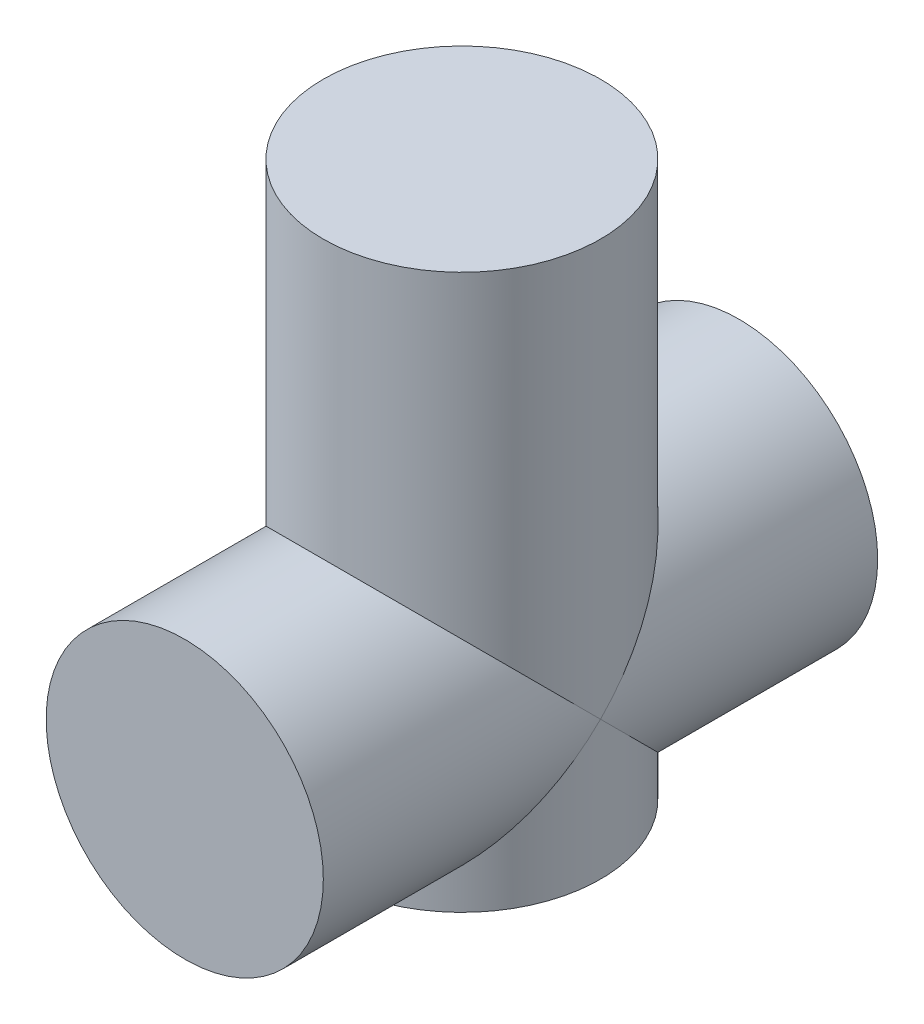
ISO-10303-21;
HEADER;
FILE_DESCRIPTION(('STEP AP214'),'2;1');
FILE_NAME('part.step','',(''),(''),'','','');
FILE_SCHEMA(('AUTOMOTIVE_DESIGN { 1 0 10303 214 1 1 1 1 }'));
ENDSEC;
DATA;
#1=APPLICATION_CONTEXT('core data for automotive mechanical design processes');
#2=APPLICATION_PROTOCOL_DEFINITION('international standard','automotive_design',2000,#1);
#3=PRODUCT_CONTEXT('',#1,'mechanical');
#4=PRODUCT('Part','Part','',(#3));
#5=PRODUCT_RELATED_PRODUCT_CATEGORY('part','',(#4));
#6=PRODUCT_DEFINITION_FORMATION('','',#4);
#7=PRODUCT_DEFINITION_CONTEXT('part definition',#1,'design');
#8=PRODUCT_DEFINITION('design','',#6,#7);
#9=PRODUCT_DEFINITION_SHAPE('','',#8);
#10=(LENGTH_UNIT() NAMED_UNIT(*) SI_UNIT(.MILLI.,.METRE.));
#11=(NAMED_UNIT(*) PLANE_ANGLE_UNIT() SI_UNIT($,.RADIAN.));
#12=(NAMED_UNIT(*) SI_UNIT($,.STERADIAN.) SOLID_ANGLE_UNIT());
#13=UNCERTAINTY_MEASURE_WITH_UNIT(LENGTH_MEASURE(1.E-05),#10,'distance_accuracy_value','');
#14=(GEOMETRIC_REPRESENTATION_CONTEXT(3) GLOBAL_UNCERTAINTY_ASSIGNED_CONTEXT((#13)) GLOBAL_UNIT_ASSIGNED_CONTEXT((#10,
#11,#12)) REPRESENTATION_CONTEXT('',''));
#15=CARTESIAN_POINT('',(0.,0.,0.));
#16=DIRECTION('',(0.,0.,1.));
#17=DIRECTION('',(1.,0.,0.));
#18=AXIS2_PLACEMENT_3D('',#15,#16,#17);
#19=CARTESIAN_POINT('',(0.,100.,0.));
#20=DIRECTION('',(0.,-1.,0.));
#21=DIRECTION('',(0.,0.,-1.));
#22=AXIS2_PLACEMENT_3D('',#19,#20,#21);
#23=CYLINDRICAL_SURFACE('',#22,25.);
#24=CARTESIAN_POINT('',(0.,25.,0.));
#25=DIRECTION('',(0.,-0.707106781186547,-0.707106781186547));
#26=DIRECTION('',(0.,-0.707106781186547,0.707106781186547));
#27=AXIS2_PLACEMENT_3D('',#24,#25,#26);
#28=ELLIPSE('',#27,35.3553390593274,25.);
#29=CARTESIAN_POINT('',(0.,0.,25.));
#30=VERTEX_POINT('',#29);
#31=CARTESIAN_POINT('',(-25.,25.,0.));
#32=VERTEX_POINT('',#31);
#33=EDGE_CURVE('E68',#30,#32,#28,.T.);
#34=ORIENTED_EDGE('',*,*,#33,.T.);
#35=CARTESIAN_POINT('',(0.,25.,0.));
#36=DIRECTION('',(0.,-0.707106781186547,0.707106781186547));
#37=DIRECTION('',(0.,-0.707106781186547,-0.707106781186547));
#38=AXIS2_PLACEMENT_3D('',#35,#36,#37);
#39=ELLIPSE('',#38,35.3553390593274,25.);
#40=CARTESIAN_POINT('',(0.,0.,-25.));
#41=VERTEX_POINT('',#40);
#42=EDGE_CURVE('E65',#32,#41,#39,.T.);
#43=ORIENTED_EDGE('',*,*,#42,.T.);
#44=CARTESIAN_POINT('',(0.,0.,0.));
#45=DIRECTION('',(0.,1.,0.));
#46=DIRECTION('',(0.,0.,1.));
#47=AXIS2_PLACEMENT_3D('',#44,#45,#46);
#48=CIRCLE('',#47,25.);
#49=EDGE_CURVE('E74',#41,#30,#48,.T.);
#50=ORIENTED_EDGE('',*,*,#49,.T.);
#51=EDGE_LOOP('',(#34,#43,#50));
#52=FACE_BOUND('',#51,.T.);
#53=ADVANCED_FACE('F33',(#52),#23,.T.);
#54=EDGE_CURVE('E37',#30,#41,#48,.T.);
#55=ORIENTED_EDGE('',*,*,#54,.T.);
#56=CARTESIAN_POINT('',(25.,25.,0.));
#57=VERTEX_POINT('',#56);
#58=EDGE_CURVE('E62',#41,#57,#39,.T.);
#59=ORIENTED_EDGE('',*,*,#58,.T.);
#60=EDGE_CURVE('E55',#57,#30,#28,.T.);
#61=ORIENTED_EDGE('',*,*,#60,.T.);
#62=EDGE_LOOP('',(#55,#59,#61));
#63=FACE_BOUND('',#62,.T.);
#64=ADVANCED_FACE('F35',(#63),#23,.T.);
#65=CARTESIAN_POINT('',(0.,0.,0.));
#66=DIRECTION('',(0.,1.,0.));
#67=DIRECTION('',(0.,0.,1.));
#68=AXIS2_PLACEMENT_3D('',#65,#66,#67);
#69=PLANE('',#68);
#70=ORIENTED_EDGE('',*,*,#49,.F.);
#71=ORIENTED_EDGE('',*,*,#54,.F.);
#72=EDGE_LOOP('',(#70,#71));
#73=FACE_BOUND('',#72,.T.);
#74=ADVANCED_FACE('F78',(#73),#69,.F.);
#75=CARTESIAN_POINT('',(0.,25.,-50.));
#76=DIRECTION('',(0.,0.,1.));
#77=DIRECTION('',(1.,0.,0.));
#78=AXIS2_PLACEMENT_3D('',#75,#76,#77);
#79=PLANE('',#78);
#80=CARTESIAN_POINT('',(0.,25.,-50.));
#81=DIRECTION('',(0.,0.,1.));
#82=DIRECTION('',(1.,0.,0.));
#83=AXIS2_PLACEMENT_3D('',#80,#81,#82);
#84=CIRCLE('',#83,25.);
#85=CARTESIAN_POINT('',(25.,25.,-50.));
#86=VERTEX_POINT('',#85);
#87=EDGE_CURVE('E82',#86,#86,#84,.T.);
#88=ORIENTED_EDGE('',*,*,#87,.F.);
#89=EDGE_LOOP('',(#88));
#90=FACE_BOUND('',#89,.T.);
#91=ADVANCED_FACE('F102',(#90),#79,.F.);
#92=CARTESIAN_POINT('',(0.,25.,-50.));
#93=DIRECTION('',(0.,0.,1.));
#94=DIRECTION('',(1.,0.,0.));
#95=AXIS2_PLACEMENT_3D('',#92,#93,#94);
#96=CYLINDRICAL_SURFACE('',#95,25.);
#97=ORIENTED_EDGE('',*,*,#87,.T.);
#98=EDGE_LOOP('',(#97));
#99=FACE_BOUND('',#98,.T.);
#100=CARTESIAN_POINT('',(0.,25.,0.));
#101=DIRECTION('',(0.,-0.707106781186547,-0.707106781186547));
#102=DIRECTION('',(0.,-0.707106781186547,0.707106781186547));
#103=AXIS2_PLACEMENT_3D('',#100,#101,#102);
#104=ELLIPSE('',#103,35.3553390593274,25.);
#105=EDGE_CURVE('E47',#57,#32,#104,.F.);
#106=ORIENTED_EDGE('',*,*,#105,.F.);
#107=ORIENTED_EDGE('',*,*,#58,.F.);
#108=ORIENTED_EDGE('',*,*,#42,.F.);
#109=EDGE_LOOP('',(#106,#107,#108));
#110=FACE_BOUND('',#109,.T.);
#111=ADVANCED_FACE('F64',(#99,#110),#96,.T.);
#112=CARTESIAN_POINT('',(0.,25.,50.));
#113=DIRECTION('',(0.,0.,1.));
#114=DIRECTION('',(1.,0.,0.));
#115=AXIS2_PLACEMENT_3D('',#112,#113,#114);
#116=CIRCLE('',#115,25.);
#117=CARTESIAN_POINT('',(25.,25.,50.));
#118=VERTEX_POINT('',#117);
#119=EDGE_CURVE('E84',#118,#118,#116,.T.);
#120=ORIENTED_EDGE('',*,*,#119,.F.);
#121=EDGE_LOOP('',(#120));
#122=FACE_BOUND('',#121,.T.);
#123=ORIENTED_EDGE('',*,*,#60,.F.);
#124=CARTESIAN_POINT('',(0.,25.,0.));
#125=DIRECTION('',(0.,-0.707106781186547,0.707106781186547));
#126=DIRECTION('',(0.,-0.707106781186547,-0.707106781186547));
#127=AXIS2_PLACEMENT_3D('',#124,#125,#126);
#128=ELLIPSE('',#127,35.3553390593274,25.);
#129=EDGE_CURVE('E76',#32,#57,#128,.F.);
#130=ORIENTED_EDGE('',*,*,#129,.F.);
#131=ORIENTED_EDGE('',*,*,#33,.F.);
#132=EDGE_LOOP('',(#123,#130,#131));
#133=FACE_BOUND('',#132,.T.);
#134=ADVANCED_FACE('F93',(#122,#133),#96,.T.);
#135=CARTESIAN_POINT('',(0.,25.,50.));
#136=DIRECTION('',(0.,0.,1.));
#137=DIRECTION('',(1.,0.,0.));
#138=AXIS2_PLACEMENT_3D('',#135,#136,#137);
#139=PLANE('',#138);
#140=ORIENTED_EDGE('',*,*,#119,.T.);
#141=EDGE_LOOP('',(#140));
#142=FACE_BOUND('',#141,.T.);
#143=ADVANCED_FACE('F91',(#142),#139,.T.);
#144=CARTESIAN_POINT('',(0.,100.,0.));
#145=DIRECTION('',(0.,1.,0.));
#146=DIRECTION('',(0.,0.,1.));
#147=AXIS2_PLACEMENT_3D('',#144,#145,#146);
#148=PLANE('',#147);
#149=CARTESIAN_POINT('',(0.,100.,0.));
#150=DIRECTION('',(0.,1.,0.));
#151=DIRECTION('',(0.,0.,1.));
#152=AXIS2_PLACEMENT_3D('',#149,#150,#151);
#153=CIRCLE('',#152,25.);
#154=CARTESIAN_POINT('',(0.,100.,25.));
#155=VERTEX_POINT('',#154);
#156=EDGE_CURVE('E11',#155,#155,#153,.T.);
#157=ORIENTED_EDGE('',*,*,#156,.T.);
#158=EDGE_LOOP('',(#157));
#159=FACE_BOUND('',#158,.T.);
#160=ADVANCED_FACE('F100',(#159),#148,.T.);
#161=ORIENTED_EDGE('',*,*,#156,.F.);
#162=EDGE_LOOP('',(#161));
#163=FACE_BOUND('',#162,.T.);
#164=ORIENTED_EDGE('',*,*,#105,.T.);
#165=ORIENTED_EDGE('',*,*,#129,.T.);
#166=EDGE_LOOP('',(#164,#165));
#167=FACE_BOUND('',#166,.T.);
#168=ADVANCED_FACE('F106',(#163,#167),#23,.T.);
#169=CLOSED_SHELL('',(#53,#64,#74,#91,#111,#134,#143,#160,#168));
#170=MANIFOLD_SOLID_BREP('B2',#169);
#171=ADVANCED_BREP_SHAPE_REPRESENTATION('',(#18,#170),#14);
#172=SHAPE_DEFINITION_REPRESENTATION(#9,#171);
ENDSEC;
END-ISO-10303-21;
